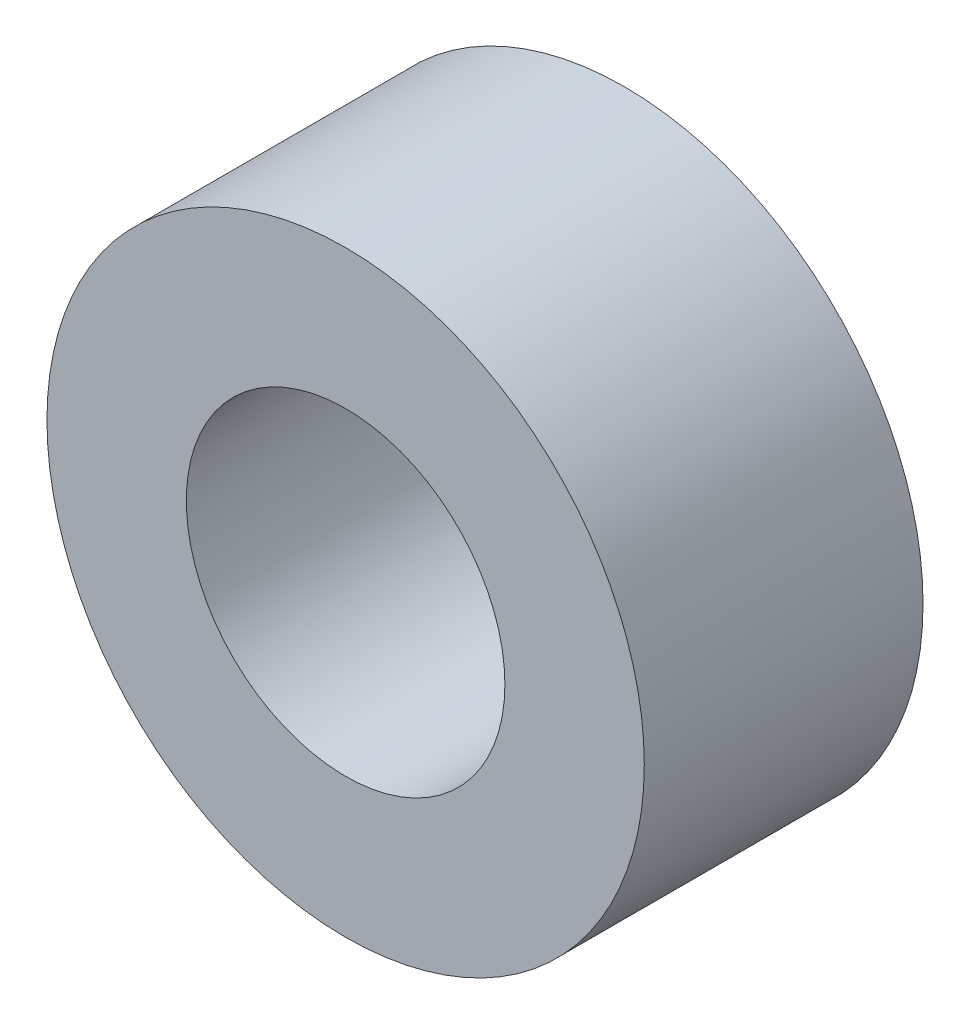
ISO-10303-21;
HEADER;
FILE_DESCRIPTION(('STEP AP214'),'2;1');
FILE_NAME('part.step','',(''),(''),'','','');
FILE_SCHEMA(('AUTOMOTIVE_DESIGN { 1 0 10303 214 1 1 1 1 }'));
ENDSEC;
DATA;
#1=APPLICATION_CONTEXT('core data for automotive mechanical design processes');
#2=APPLICATION_PROTOCOL_DEFINITION('international standard','automotive_design',2000,#1);
#3=PRODUCT_CONTEXT('',#1,'mechanical');
#4=PRODUCT('Part','Part','',(#3));
#5=PRODUCT_RELATED_PRODUCT_CATEGORY('part','',(#4));
#6=PRODUCT_DEFINITION_FORMATION('','',#4);
#7=PRODUCT_DEFINITION_CONTEXT('part definition',#1,'design');
#8=PRODUCT_DEFINITION('design','',#6,#7);
#9=PRODUCT_DEFINITION_SHAPE('','',#8);
#10=(LENGTH_UNIT() NAMED_UNIT(*) SI_UNIT(.MILLI.,.METRE.));
#11=(NAMED_UNIT(*) PLANE_ANGLE_UNIT() SI_UNIT($,.RADIAN.));
#12=(NAMED_UNIT(*) SI_UNIT($,.STERADIAN.) SOLID_ANGLE_UNIT());
#13=UNCERTAINTY_MEASURE_WITH_UNIT(LENGTH_MEASURE(1.E-05),#10,'distance_accuracy_value','');
#14=(GEOMETRIC_REPRESENTATION_CONTEXT(3) GLOBAL_UNCERTAINTY_ASSIGNED_CONTEXT((#13)) GLOBAL_UNIT_ASSIGNED_CONTEXT((#10,
#11,#12)) REPRESENTATION_CONTEXT('',''));
#15=CARTESIAN_POINT('',(0.,0.,0.));
#16=DIRECTION('',(0.,0.,1.));
#17=DIRECTION('',(1.,0.,0.));
#18=AXIS2_PLACEMENT_3D('',#15,#16,#17);
#19=CARTESIAN_POINT('',(0.,0.,7.));
#20=DIRECTION('',(0.,0.,1.));
#21=DIRECTION('',(1.,0.,0.));
#22=AXIS2_PLACEMENT_3D('',#19,#20,#21);
#23=PLANE('',#22);
#24=CARTESIAN_POINT('',(0.,0.,7.));
#25=DIRECTION('',(0.,0.,1.));
#26=DIRECTION('',(1.,0.,0.));
#27=AXIS2_PLACEMENT_3D('',#24,#25,#26);
#28=CIRCLE('',#27,7.5);
#29=CARTESIAN_POINT('',(7.5,0.,7.));
#30=VERTEX_POINT('',#29);
#31=EDGE_CURVE('E10',#30,#30,#28,.T.);
#32=ORIENTED_EDGE('',*,*,#31,.T.);
#33=EDGE_LOOP('',(#32));
#34=FACE_BOUND('',#33,.T.);
#35=CARTESIAN_POINT('',(0.,0.,7.));
#36=DIRECTION('',(0.,0.,1.));
#37=DIRECTION('',(1.,0.,0.));
#38=AXIS2_PLACEMENT_3D('',#35,#36,#37);
#39=CIRCLE('',#38,4.);
#40=CARTESIAN_POINT('',(4.,0.,7.));
#41=VERTEX_POINT('',#40);
#42=EDGE_CURVE('E48',#41,#41,#39,.T.);
#43=ORIENTED_EDGE('',*,*,#42,.F.);
#44=EDGE_LOOP('',(#43));
#45=FACE_BOUND('',#44,.T.);
#46=ADVANCED_FACE('F37',(#34,#45),#23,.T.);
#47=CARTESIAN_POINT('',(0.,0.,0.));
#48=DIRECTION('',(0.,0.,1.));
#49=DIRECTION('',(1.,0.,0.));
#50=AXIS2_PLACEMENT_3D('',#47,#48,#49);
#51=PLANE('',#50);
#52=CARTESIAN_POINT('',(0.,0.,0.));
#53=DIRECTION('',(0.,0.,1.));
#54=DIRECTION('',(1.,0.,0.));
#55=AXIS2_PLACEMENT_3D('',#52,#53,#54);
#56=CIRCLE('',#55,7.5);
#57=CARTESIAN_POINT('',(7.5,0.,0.));
#58=VERTEX_POINT('',#57);
#59=EDGE_CURVE('E41',#58,#58,#56,.T.);
#60=ORIENTED_EDGE('',*,*,#59,.F.);
#61=EDGE_LOOP('',(#60));
#62=FACE_BOUND('',#61,.T.);
#63=CARTESIAN_POINT('',(0.,0.,0.));
#64=DIRECTION('',(0.,0.,1.));
#65=DIRECTION('',(1.,0.,0.));
#66=AXIS2_PLACEMENT_3D('',#63,#64,#65);
#67=CIRCLE('',#66,4.);
#68=CARTESIAN_POINT('',(4.,0.,0.));
#69=VERTEX_POINT('',#68);
#70=EDGE_CURVE('E50',#69,#69,#67,.T.);
#71=ORIENTED_EDGE('',*,*,#70,.T.);
#72=EDGE_LOOP('',(#71));
#73=FACE_BOUND('',#72,.T.);
#74=ADVANCED_FACE('F60',(#62,#73),#51,.F.);
#75=CARTESIAN_POINT('',(0.,0.,7.));
#76=DIRECTION('',(0.,0.,-1.));
#77=DIRECTION('',(-1.,0.,0.));
#78=AXIS2_PLACEMENT_3D('',#75,#76,#77);
#79=CYLINDRICAL_SURFACE('',#78,7.5);
#80=ORIENTED_EDGE('',*,*,#31,.F.);
#81=EDGE_LOOP('',(#80));
#82=FACE_BOUND('',#81,.T.);
#83=ORIENTED_EDGE('',*,*,#59,.T.);
#84=EDGE_LOOP('',(#83));
#85=FACE_BOUND('',#84,.T.);
#86=ADVANCED_FACE('F39',(#82,#85),#79,.T.);
#87=CARTESIAN_POINT('',(0.,0.,7.));
#88=DIRECTION('',(0.,0.,-1.));
#89=DIRECTION('',(-1.,0.,0.));
#90=AXIS2_PLACEMENT_3D('',#87,#88,#89);
#91=CYLINDRICAL_SURFACE('',#90,4.);
#92=ORIENTED_EDGE('',*,*,#42,.T.);
#93=EDGE_LOOP('',(#92));
#94=FACE_BOUND('',#93,.T.);
#95=ORIENTED_EDGE('',*,*,#70,.F.);
#96=EDGE_LOOP('',(#95));
#97=FACE_BOUND('',#96,.T.);
#98=ADVANCED_FACE('F56',(#94,#97),#91,.F.);
#99=CLOSED_SHELL('',(#46,#74,#86,#98));
#100=MANIFOLD_SOLID_BREP('B2',#99);
#101=ADVANCED_BREP_SHAPE_REPRESENTATION('',(#18,#100),#14);
#102=SHAPE_DEFINITION_REPRESENTATION(#9,#101);
ENDSEC;
END-ISO-10303-21;
